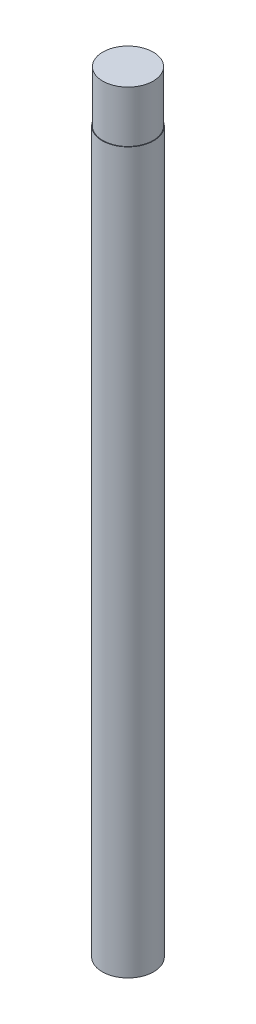
ISO-10303-21;
HEADER;
FILE_DESCRIPTION(('STEP AP214'),'2;1');
FILE_NAME('part.step','',(''),(''),'','','');
FILE_SCHEMA(('AUTOMOTIVE_DESIGN { 1 0 10303 214 1 1 1 1 }'));
ENDSEC;
DATA;
#1=APPLICATION_CONTEXT('core data for automotive mechanical design processes');
#2=APPLICATION_PROTOCOL_DEFINITION('international standard','automotive_design',2000,#1);
#3=PRODUCT_CONTEXT('',#1,'mechanical');
#4=PRODUCT('Part','Part','',(#3));
#5=PRODUCT_RELATED_PRODUCT_CATEGORY('part','',(#4));
#6=PRODUCT_DEFINITION_FORMATION('','',#4);
#7=PRODUCT_DEFINITION_CONTEXT('part definition',#1,'design');
#8=PRODUCT_DEFINITION('design','',#6,#7);
#9=PRODUCT_DEFINITION_SHAPE('','',#8);
#10=(LENGTH_UNIT() NAMED_UNIT(*) SI_UNIT(.MILLI.,.METRE.));
#11=(NAMED_UNIT(*) PLANE_ANGLE_UNIT() SI_UNIT($,.RADIAN.));
#12=(NAMED_UNIT(*) SI_UNIT($,.STERADIAN.) SOLID_ANGLE_UNIT());
#13=UNCERTAINTY_MEASURE_WITH_UNIT(LENGTH_MEASURE(1.E-05),#10,'distance_accuracy_value','');
#14=(GEOMETRIC_REPRESENTATION_CONTEXT(3) GLOBAL_UNCERTAINTY_ASSIGNED_CONTEXT((#13)) GLOBAL_UNIT_ASSIGNED_CONTEXT((#10,
#11,#12)) REPRESENTATION_CONTEXT('',''));
#15=CARTESIAN_POINT('',(0.,0.,0.));
#16=DIRECTION('',(0.,0.,1.));
#17=DIRECTION('',(1.,0.,0.));
#18=AXIS2_PLACEMENT_3D('',#15,#16,#17);
#19=CARTESIAN_POINT('',(0.,150.,0.));
#20=DIRECTION('',(0.,-1.,0.));
#21=DIRECTION('',(0.,0.,-1.));
#22=AXIS2_PLACEMENT_3D('',#19,#20,#21);
#23=CYLINDRICAL_SURFACE('',#22,5.);
#24=CARTESIAN_POINT('',(0.,0.,0.));
#25=DIRECTION('',(0.,1.,0.));
#26=DIRECTION('',(0.,0.,1.));
#27=AXIS2_PLACEMENT_3D('',#24,#25,#26);
#28=CIRCLE('',#27,5.);
#29=CARTESIAN_POINT('',(0.,0.,5.));
#30=VERTEX_POINT('',#29);
#31=EDGE_CURVE('E10',#30,#30,#28,.T.);
#32=ORIENTED_EDGE('',*,*,#31,.T.);
#33=EDGE_LOOP('',(#32));
#34=FACE_BOUND('',#33,.T.);
#35=CARTESIAN_POINT('',(0.,140.,0.));
#36=DIRECTION('',(0.,1.,0.));
#37=DIRECTION('',(0.,0.,1.));
#38=AXIS2_PLACEMENT_3D('',#35,#36,#37);
#39=CIRCLE('',#38,5.);
#40=CARTESIAN_POINT('',(0.,140.,5.));
#41=VERTEX_POINT('',#40);
#42=EDGE_CURVE('E37',#41,#41,#39,.T.);
#43=ORIENTED_EDGE('',*,*,#42,.F.);
#44=EDGE_LOOP('',(#43));
#45=FACE_BOUND('',#44,.T.);
#46=ADVANCED_FACE('F31',(#34,#45),#23,.T.);
#47=CARTESIAN_POINT('',(0.,0.,0.));
#48=DIRECTION('',(0.,1.,0.));
#49=DIRECTION('',(0.,0.,1.));
#50=AXIS2_PLACEMENT_3D('',#47,#48,#49);
#51=PLANE('',#50);
#52=ORIENTED_EDGE('',*,*,#31,.F.);
#53=EDGE_LOOP('',(#52));
#54=FACE_BOUND('',#53,.T.);
#55=ADVANCED_FACE('F63',(#54),#51,.F.);
#56=CARTESIAN_POINT('',(0.,140.,0.));
#57=DIRECTION('',(0.,1.,0.));
#58=DIRECTION('',(0.,0.,1.));
#59=AXIS2_PLACEMENT_3D('',#56,#57,#58);
#60=PLANE('',#59);
#61=CARTESIAN_POINT('',(0.,140.,0.));
#62=DIRECTION('',(0.,1.,0.));
#63=DIRECTION('',(0.,0.,1.));
#64=AXIS2_PLACEMENT_3D('',#61,#62,#63);
#65=CIRCLE('',#64,4.9);
#66=CARTESIAN_POINT('',(0.,140.,4.9));
#67=VERTEX_POINT('',#66);
#68=EDGE_CURVE('E41',#67,#67,#65,.T.);
#69=ORIENTED_EDGE('',*,*,#68,.F.);
#70=EDGE_LOOP('',(#69));
#71=FACE_BOUND('',#70,.T.);
#72=ORIENTED_EDGE('',*,*,#42,.T.);
#73=EDGE_LOOP('',(#72));
#74=FACE_BOUND('',#73,.T.);
#75=ADVANCED_FACE('F55',(#71,#74),#60,.T.);
#76=CARTESIAN_POINT('',(0.,140.,0.));
#77=DIRECTION('',(0.,1.,0.));
#78=DIRECTION('',(0.,0.,1.));
#79=AXIS2_PLACEMENT_3D('',#76,#77,#78);
#80=CYLINDRICAL_SURFACE('',#79,4.9);
#81=ORIENTED_EDGE('',*,*,#68,.T.);
#82=EDGE_LOOP('',(#81));
#83=FACE_BOUND('',#82,.T.);
#84=CARTESIAN_POINT('',(0.,150.,0.));
#85=DIRECTION('',(0.,1.,0.));
#86=DIRECTION('',(0.,0.,1.));
#87=AXIS2_PLACEMENT_3D('',#84,#85,#86);
#88=CIRCLE('',#87,4.9);
#89=CARTESIAN_POINT('',(0.,150.,4.9));
#90=VERTEX_POINT('',#89);
#91=EDGE_CURVE('E45',#90,#90,#88,.T.);
#92=ORIENTED_EDGE('',*,*,#91,.F.);
#93=EDGE_LOOP('',(#92));
#94=FACE_BOUND('',#93,.T.);
#95=ADVANCED_FACE('F53',(#83,#94),#80,.T.);
#96=CARTESIAN_POINT('',(0.,150.,0.));
#97=DIRECTION('',(0.,1.,0.));
#98=DIRECTION('',(0.,0.,1.));
#99=AXIS2_PLACEMENT_3D('',#96,#97,#98);
#100=PLANE('',#99);
#101=ORIENTED_EDGE('',*,*,#91,.T.);
#102=EDGE_LOOP('',(#101));
#103=FACE_BOUND('',#102,.T.);
#104=ADVANCED_FACE('F51',(#103),#100,.T.);
#105=CLOSED_SHELL('',(#46,#55,#75,#95,#104));
#106=MANIFOLD_SOLID_BREP('B2',#105);
#107=ADVANCED_BREP_SHAPE_REPRESENTATION('',(#18,#106),#14);
#108=SHAPE_DEFINITION_REPRESENTATION(#9,#107);
ENDSEC;
END-ISO-10303-21;
